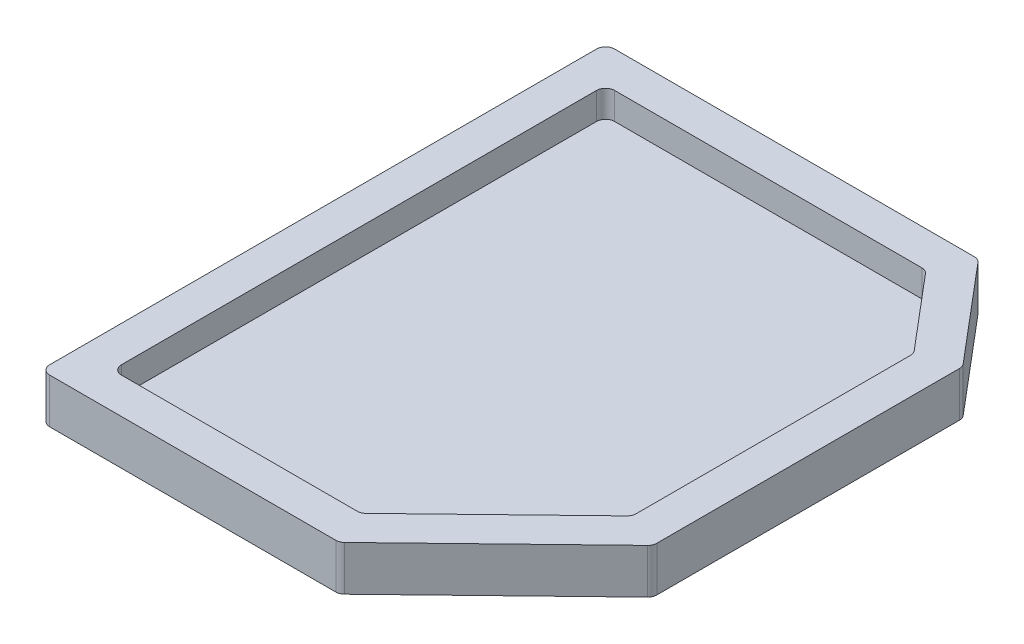
ISO-10303-21;
HEADER;
FILE_DESCRIPTION(('STEP AP214'),'2;1');
FILE_NAME('part.step','',(''),(''),'','','');
FILE_SCHEMA(('AUTOMOTIVE_DESIGN { 1 0 10303 214 1 1 1 1 }'));
ENDSEC;
DATA;
#1=APPLICATION_CONTEXT('core data for automotive mechanical design processes');
#2=APPLICATION_PROTOCOL_DEFINITION('international standard','automotive_design',2000,#1);
#3=PRODUCT_CONTEXT('',#1,'mechanical');
#4=PRODUCT('Part','Part','',(#3));
#5=PRODUCT_RELATED_PRODUCT_CATEGORY('part','',(#4));
#6=PRODUCT_DEFINITION_FORMATION('','',#4);
#7=PRODUCT_DEFINITION_CONTEXT('part definition',#1,'design');
#8=PRODUCT_DEFINITION('design','',#6,#7);
#9=PRODUCT_DEFINITION_SHAPE('','',#8);
#10=(LENGTH_UNIT() NAMED_UNIT(*) SI_UNIT(.MILLI.,.METRE.));
#11=(NAMED_UNIT(*) PLANE_ANGLE_UNIT() SI_UNIT($,.RADIAN.));
#12=(NAMED_UNIT(*) SI_UNIT($,.STERADIAN.) SOLID_ANGLE_UNIT());
#13=UNCERTAINTY_MEASURE_WITH_UNIT(LENGTH_MEASURE(1.E-05),#10,'distance_accuracy_value','');
#14=(GEOMETRIC_REPRESENTATION_CONTEXT(3) GLOBAL_UNCERTAINTY_ASSIGNED_CONTEXT((#13)) GLOBAL_UNIT_ASSIGNED_CONTEXT((#10,
#11,#12)) REPRESENTATION_CONTEXT('',''));
#15=CARTESIAN_POINT('',(0.,0.,0.));
#16=DIRECTION('',(0.,0.,1.));
#17=DIRECTION('',(1.,0.,0.));
#18=AXIS2_PLACEMENT_3D('',#15,#16,#17);
#19=CARTESIAN_POINT('',(0.,5.,0.));
#20=DIRECTION('',(0.,-1.,0.));
#21=DIRECTION('',(0.,0.,-1.));
#22=AXIS2_PLACEMENT_3D('',#19,#20,#21);
#23=PLANE('',#22);
#24=DIRECTION('',(-1.,0.,0.));
#25=VECTOR('',#24,1.);
#26=CARTESIAN_POINT('',(-4.5,5.,-58.5));
#27=LINE('',#26,#25);
#28=CARTESIAN_POINT('',(36.6251985368632,5.,-58.5));
#29=VERTEX_POINT('',#28);
#30=CARTESIAN_POINT('',(-3.5,5.,-58.5));
#31=VERTEX_POINT('',#30);
#32=EDGE_CURVE('E455',#29,#31,#27,.T.);
#33=ORIENTED_EDGE('',*,*,#32,.T.);
#34=CARTESIAN_POINT('',(-3.5,5.,-57.5));
#35=DIRECTION('',(0.,-1.,0.));
#36=DIRECTION('',(0.,0.,-1.));
#37=AXIS2_PLACEMENT_3D('',#34,#35,#36);
#38=CIRCLE('',#37,1.);
#39=CARTESIAN_POINT('',(-4.5,5.,-57.5));
#40=VERTEX_POINT('',#39);
#41=EDGE_CURVE('E278',#31,#40,#38,.F.);
#42=ORIENTED_EDGE('',*,*,#41,.T.);
#43=DIRECTION('',(0.,0.,1.));
#44=VECTOR('',#43,1.);
#45=CARTESIAN_POINT('',(-4.5,5.,4.5));
#46=LINE('',#45,#44);
#47=CARTESIAN_POINT('',(-4.5,5.,3.5));
#48=VERTEX_POINT('',#47);
#49=EDGE_CURVE('E223',#40,#48,#46,.T.);
#50=ORIENTED_EDGE('',*,*,#49,.T.);
#51=CARTESIAN_POINT('',(-3.5,5.,3.5));
#52=DIRECTION('',(0.,-1.,0.));
#53=DIRECTION('',(0.,0.,-1.));
#54=AXIS2_PLACEMENT_3D('',#51,#52,#53);
#55=CIRCLE('',#54,1.);
#56=CARTESIAN_POINT('',(-3.5,5.,4.5));
#57=VERTEX_POINT('',#56);
#58=EDGE_CURVE('E269',#48,#57,#55,.F.);
#59=ORIENTED_EDGE('',*,*,#58,.T.);
#60=DIRECTION('',(1.,0.,0.));
#61=VECTOR('',#60,1.);
#62=CARTESIAN_POINT('',(28.8196040629854,5.,4.5));
#63=LINE('',#62,#61);
#64=CARTESIAN_POINT('',(28.4152476045442,5.,4.5));
#65=VERTEX_POINT('',#64);
#66=EDGE_CURVE('E232',#57,#65,#63,.T.);
#67=ORIENTED_EDGE('',*,*,#66,.T.);
#68=CARTESIAN_POINT('',(28.4152476045442,5.,3.5));
#69=DIRECTION('',(0.,-1.,0.));
#70=DIRECTION('',(0.,0.,-1.));
#71=AXIS2_PLACEMENT_3D('',#68,#69,#70);
#72=CIRCLE('',#71,1.);
#73=CARTESIAN_POINT('',(29.1103142444199,5.,4.21894531511923));
#74=VERTEX_POINT('',#73);
#75=EDGE_CURVE('E266',#65,#74,#72,.F.);
#76=ORIENTED_EDGE('',*,*,#75,.T.);
#77=DIRECTION('',(0.718945315119227,0.,-0.695066639875714));
#78=VECTOR('',#77,1.);
#79=CARTESIAN_POINT('',(46.5978516175038,5.,-12.6877700998002));
#80=LINE('',#79,#78);
#81=CARTESIAN_POINT('',(46.2929182573795,5.,-12.3929646374787));
#82=VERTEX_POINT('',#81);
#83=EDGE_CURVE('E238',#74,#82,#80,.T.);
#84=ORIENTED_EDGE('',*,*,#83,.T.);
#85=CARTESIAN_POINT('',(45.5978516175038,5.,-13.1119099525979));
#86=DIRECTION('',(0.,-1.,0.));
#87=DIRECTION('',(0.,0.,-1.));
#88=AXIS2_PLACEMENT_3D('',#85,#86,#87);
#89=CIRCLE('',#88,1.);
#90=CARTESIAN_POINT('',(46.5978516175038,5.,-13.1119099525979));
#91=VERTEX_POINT('',#90);
#92=EDGE_CURVE('E263',#82,#91,#89,.F.);
#93=ORIENTED_EDGE('',*,*,#92,.T.);
#94=DIRECTION('',(0.,0.,-1.));
#95=VECTOR('',#94,1.);
#96=CARTESIAN_POINT('',(46.5978516175038,5.,-47.2425028075199));
#97=LINE('',#96,#95);
#98=CARTESIAN_POINT('',(46.5978516175038,5.,-46.8767020586021));
#99=VERTEX_POINT('',#98);
#100=EDGE_CURVE('E447',#91,#99,#97,.T.);
#101=ORIENTED_EDGE('',*,*,#100,.T.);
#102=CARTESIAN_POINT('',(45.5978516175038,5.,-46.8767020586021));
#103=DIRECTION('',(0.,-1.,0.));
#104=DIRECTION('',(0.,0.,-1.));
#105=AXIS2_PLACEMENT_3D('',#102,#103,#104);
#106=CIRCLE('',#105,1.);
#107=CARTESIAN_POINT('',(46.3618153050138,5.,-47.521961296557));
#108=VERTEX_POINT('',#107);
#109=EDGE_CURVE('E272',#99,#108,#106,.F.);
#110=ORIENTED_EDGE('',*,*,#109,.T.);
#111=DIRECTION('',(-0.645259237954887,0.,-0.763963687510001));
#112=VECTOR('',#111,1.);
#113=CARTESIAN_POINT('',(37.089540975967,5.,-58.5));
#114=LINE('',#113,#112);
#115=CARTESIAN_POINT('',(37.3891622243732,5.,-58.1452592379549));
#116=VERTEX_POINT('',#115);
#117=EDGE_CURVE('E451',#108,#116,#114,.T.);
#118=ORIENTED_EDGE('',*,*,#117,.T.);
#119=CARTESIAN_POINT('',(36.6251985368632,5.,-57.5));
#120=DIRECTION('',(0.,-1.,0.));
#121=DIRECTION('',(0.,0.,-1.));
#122=AXIS2_PLACEMENT_3D('',#119,#120,#121);
#123=CIRCLE('',#122,1.);
#124=EDGE_CURVE('E275',#116,#29,#123,.F.);
#125=ORIENTED_EDGE('',*,*,#124,.T.);
#126=EDGE_LOOP('',(#33,#42,#50,#59,#67,#76,#84,#93,#101,#110,#118,#125));
#127=FACE_BOUND('',#126,.T.);
#128=DIRECTION('',(1.,0.,0.));
#129=VECTOR('',#128,1.);
#130=CARTESIAN_POINT('',(27.2021782292206,5.,0.5));
#131=LINE('',#130,#129);
#132=CARTESIAN_POINT('',(0.5,5.,0.5));
#133=VERTEX_POINT('',#132);
#134=CARTESIAN_POINT('',(26.7978217707794,5.,0.5));
#135=VERTEX_POINT('',#134);
#136=EDGE_CURVE('E383',#133,#135,#131,.T.);
#137=ORIENTED_EDGE('',*,*,#136,.F.);
#138=CARTESIAN_POINT('',(0.5,5.,-0.5));
#139=DIRECTION('',(0.,-1.,0.));
#140=DIRECTION('',(0.,0.,-1.));
#141=AXIS2_PLACEMENT_3D('',#138,#139,#140);
#142=CIRCLE('',#141,1.);
#143=CARTESIAN_POINT('',(-0.5,5.,-0.5));
#144=VERTEX_POINT('',#143);
#145=EDGE_CURVE('E11',#133,#144,#142,.T.);
#146=ORIENTED_EDGE('',*,*,#145,.T.);
#147=DIRECTION('',(0.,0.,1.));
#148=VECTOR('',#147,1.);
#149=CARTESIAN_POINT('',(-0.5,5.,0.5));
#150=LINE('',#149,#148);
#151=CARTESIAN_POINT('',(-0.5,5.,-53.5));
#152=VERTEX_POINT('',#151);
#153=EDGE_CURVE('E439',#152,#144,#150,.T.);
#154=ORIENTED_EDGE('',*,*,#153,.F.);
#155=CARTESIAN_POINT('',(0.5,5.,-53.5));
#156=DIRECTION('',(0.,-1.,0.));
#157=DIRECTION('',(0.,0.,-1.));
#158=AXIS2_PLACEMENT_3D('',#155,#156,#157);
#159=CIRCLE('',#158,1.);
#160=CARTESIAN_POINT('',(0.5,5.,-54.5));
#161=VERTEX_POINT('',#160);
#162=EDGE_CURVE('E366',#152,#161,#159,.T.);
#163=ORIENTED_EDGE('',*,*,#162,.T.);
#164=DIRECTION('',(-1.,0.,0.));
#165=VECTOR('',#164,1.);
#166=CARTESIAN_POINT('',(-0.5,5.,-54.5));
#167=LINE('',#166,#165);
#168=CARTESIAN_POINT('',(34.7678287804481,5.,-54.5));
#169=VERTEX_POINT('',#168);
#170=EDGE_CURVE('E435',#169,#161,#167,.T.);
#171=ORIENTED_EDGE('',*,*,#170,.F.);
#172=CARTESIAN_POINT('',(34.7678287804481,5.,-53.5));
#173=DIRECTION('',(0.,-1.,0.));
#174=DIRECTION('',(0.,0.,-1.));
#175=AXIS2_PLACEMENT_3D('',#172,#173,#174);
#176=CIRCLE('',#175,1.);
#177=CARTESIAN_POINT('',(35.5317924679581,5.,-54.1452592379549));
#178=VERTEX_POINT('',#177);
#179=EDGE_CURVE('E369',#169,#178,#176,.T.);
#180=ORIENTED_EDGE('',*,*,#179,.T.);
#181=DIRECTION('',(-0.645259237954887,0.,-0.763963687510001));
#182=VECTOR('',#181,1.);
#183=CARTESIAN_POINT('',(35.2321712195519,5.,-54.5));
#184=LINE('',#183,#182);
#185=CARTESIAN_POINT('',(42.3618153050138,5.,-46.058758300886));
#186=VERTEX_POINT('',#185);
#187=EDGE_CURVE('E431',#186,#178,#184,.T.);
#188=ORIENTED_EDGE('',*,*,#187,.F.);
#189=CARTESIAN_POINT('',(41.5978516175038,5.,-45.4134990629311));
#190=DIRECTION('',(0.,-1.,0.));
#191=DIRECTION('',(0.,0.,-1.));
#192=AXIS2_PLACEMENT_3D('',#189,#190,#191);
#193=CIRCLE('',#192,1.);
#194=CARTESIAN_POINT('',(42.5978516175038,5.,-45.4134990629311));
#195=VERTEX_POINT('',#194);
#196=EDGE_CURVE('E372',#186,#195,#193,.T.);
#197=ORIENTED_EDGE('',*,*,#196,.T.);
#198=DIRECTION('',(0.,0.,-1.));
#199=VECTOR('',#198,1.);
#200=CARTESIAN_POINT('',(42.5978516175038,5.,-45.7792998118489));
#201=LINE('',#200,#199);
#202=CARTESIAN_POINT('',(42.5978516175038,5.,-14.8084693637889));
#203=VERTEX_POINT('',#202);
#204=EDGE_CURVE('E427',#203,#195,#201,.T.);
#205=ORIENTED_EDGE('',*,*,#204,.F.);
#206=CARTESIAN_POINT('',(41.5978516175038,5.,-14.8084693637889));
#207=DIRECTION('',(0.,-1.,0.));
#208=DIRECTION('',(0.,0.,-1.));
#209=AXIS2_PLACEMENT_3D('',#206,#207,#208);
#210=CIRCLE('',#209,1.);
#211=CARTESIAN_POINT('',(42.2929182573795,5.,-14.0895240486696));
#212=VERTEX_POINT('',#211);
#213=EDGE_CURVE('E375',#203,#212,#210,.T.);
#214=ORIENTED_EDGE('',*,*,#213,.T.);
#215=DIRECTION('',(0.718945315119227,0.,-0.695066639875714));
#216=VECTOR('',#215,1.);
#217=CARTESIAN_POINT('',(42.5978516175038,5.,-14.3843295109911));
#218=LINE('',#217,#216);
#219=CARTESIAN_POINT('',(27.4928884106551,5.,0.218945315119227));
#220=VERTEX_POINT('',#219);
#221=EDGE_CURVE('E386',#220,#212,#218,.T.);
#222=ORIENTED_EDGE('',*,*,#221,.F.);
#223=CARTESIAN_POINT('',(26.7978217707794,5.,-0.5));
#224=DIRECTION('',(0.,-1.,0.));
#225=DIRECTION('',(0.,0.,-1.));
#226=AXIS2_PLACEMENT_3D('',#223,#224,#225);
#227=CIRCLE('',#226,1.);
#228=EDGE_CURVE('E48',#220,#135,#227,.T.);
#229=ORIENTED_EDGE('',*,*,#228,.T.);
#230=EDGE_LOOP('',(#137,#146,#154,#163,#171,#180,#188,#197,#205,#214,#222,#229));
#231=FACE_BOUND('',#230,.T.);
#232=ADVANCED_FACE('F39',(#127,#231),#23,.F.);
#233=CARTESIAN_POINT('',(0.,0.,0.));
#234=DIRECTION('',(0.,-1.,0.));
#235=DIRECTION('',(0.,0.,-1.));
#236=AXIS2_PLACEMENT_3D('',#233,#234,#235);
#237=PLANE('',#236);
#238=DIRECTION('',(0.,0.,1.));
#239=VECTOR('',#238,1.);
#240=CARTESIAN_POINT('',(-4.5,0.,4.5));
#241=LINE('',#240,#239);
#242=CARTESIAN_POINT('',(-4.5,0.,-57.5));
#243=VERTEX_POINT('',#242);
#244=CARTESIAN_POINT('',(-4.5,0.,3.5));
#245=VERTEX_POINT('',#244);
#246=EDGE_CURVE('E220',#243,#245,#241,.T.);
#247=ORIENTED_EDGE('',*,*,#246,.F.);
#248=CARTESIAN_POINT('',(-3.5,0.,-57.5));
#249=DIRECTION('',(0.,-1.,0.));
#250=DIRECTION('',(0.,0.,-1.));
#251=AXIS2_PLACEMENT_3D('',#248,#249,#250);
#252=CIRCLE('',#251,1.);
#253=CARTESIAN_POINT('',(-3.5,0.,-58.5));
#254=VERTEX_POINT('',#253);
#255=EDGE_CURVE('E202',#243,#254,#252,.T.);
#256=ORIENTED_EDGE('',*,*,#255,.T.);
#257=DIRECTION('',(-1.,0.,0.));
#258=VECTOR('',#257,1.);
#259=CARTESIAN_POINT('',(-4.5,0.,-58.5));
#260=LINE('',#259,#258);
#261=CARTESIAN_POINT('',(36.6251985368632,0.,-58.5));
#262=VERTEX_POINT('',#261);
#263=EDGE_CURVE('E233',#262,#254,#260,.T.);
#264=ORIENTED_EDGE('',*,*,#263,.F.);
#265=CARTESIAN_POINT('',(36.6251985368632,0.,-57.5));
#266=DIRECTION('',(0.,-1.,0.));
#267=DIRECTION('',(0.,0.,-1.));
#268=AXIS2_PLACEMENT_3D('',#265,#266,#267);
#269=CIRCLE('',#268,1.);
#270=CARTESIAN_POINT('',(37.3891622243732,0.,-58.1452592379549));
#271=VERTEX_POINT('',#270);
#272=EDGE_CURVE('E214',#262,#271,#269,.T.);
#273=ORIENTED_EDGE('',*,*,#272,.T.);
#274=DIRECTION('',(-0.645259237954887,0.,-0.763963687510001));
#275=VECTOR('',#274,1.);
#276=CARTESIAN_POINT('',(37.089540975967,0.,-58.5));
#277=LINE('',#276,#275);
#278=CARTESIAN_POINT('',(46.3618153050138,0.,-47.521961296557));
#279=VERTEX_POINT('',#278);
#280=EDGE_CURVE('E240',#279,#271,#277,.T.);
#281=ORIENTED_EDGE('',*,*,#280,.F.);
#282=CARTESIAN_POINT('',(45.5978516175038,0.,-46.8767020586021));
#283=DIRECTION('',(0.,-1.,0.));
#284=DIRECTION('',(0.,0.,-1.));
#285=AXIS2_PLACEMENT_3D('',#282,#283,#284);
#286=CIRCLE('',#285,1.);
#287=CARTESIAN_POINT('',(46.5978516175038,0.,-46.8767020586021));
#288=VERTEX_POINT('',#287);
#289=EDGE_CURVE('E253',#279,#288,#286,.T.);
#290=ORIENTED_EDGE('',*,*,#289,.T.);
#291=DIRECTION('',(0.,0.,-1.));
#292=VECTOR('',#291,1.);
#293=CARTESIAN_POINT('',(46.5978516175038,0.,-47.2425028075199));
#294=LINE('',#293,#292);
#295=CARTESIAN_POINT('',(46.5978516175038,0.,-13.1119099525979));
#296=VERTEX_POINT('',#295);
#297=EDGE_CURVE('E468',#296,#288,#294,.T.);
#298=ORIENTED_EDGE('',*,*,#297,.F.);
#299=CARTESIAN_POINT('',(45.5978516175038,0.,-13.1119099525979));
#300=DIRECTION('',(0.,-1.,0.));
#301=DIRECTION('',(0.,0.,-1.));
#302=AXIS2_PLACEMENT_3D('',#299,#300,#301);
#303=CIRCLE('',#302,1.);
#304=CARTESIAN_POINT('',(46.2929182573795,0.,-12.3929646374787));
#305=VERTEX_POINT('',#304);
#306=EDGE_CURVE('E225',#296,#305,#303,.T.);
#307=ORIENTED_EDGE('',*,*,#306,.T.);
#308=DIRECTION('',(0.718945315119227,0.,-0.695066639875714));
#309=VECTOR('',#308,1.);
#310=CARTESIAN_POINT('',(46.5978516175038,0.,-12.6877700998002));
#311=LINE('',#310,#309);
#312=CARTESIAN_POINT('',(29.1103142444199,0.,4.21894531511923));
#313=VERTEX_POINT('',#312);
#314=EDGE_CURVE('E464',#313,#305,#311,.T.);
#315=ORIENTED_EDGE('',*,*,#314,.F.);
#316=CARTESIAN_POINT('',(28.4152476045442,0.,3.5));
#317=DIRECTION('',(0.,-1.,0.));
#318=DIRECTION('',(0.,0.,-1.));
#319=AXIS2_PLACEMENT_3D('',#316,#317,#318);
#320=CIRCLE('',#319,1.);
#321=CARTESIAN_POINT('',(28.4152476045442,0.,4.5));
#322=VERTEX_POINT('',#321);
#323=EDGE_CURVE('E248',#313,#322,#320,.T.);
#324=ORIENTED_EDGE('',*,*,#323,.T.);
#325=DIRECTION('',(1.,0.,0.));
#326=VECTOR('',#325,1.);
#327=CARTESIAN_POINT('',(28.8196040629854,0.,4.5));
#328=LINE('',#327,#326);
#329=CARTESIAN_POINT('',(-3.5,0.,4.5));
#330=VERTEX_POINT('',#329);
#331=EDGE_CURVE('E442',#330,#322,#328,.T.);
#332=ORIENTED_EDGE('',*,*,#331,.F.);
#333=CARTESIAN_POINT('',(-3.5,0.,3.5));
#334=DIRECTION('',(0.,-1.,0.));
#335=DIRECTION('',(0.,0.,-1.));
#336=AXIS2_PLACEMENT_3D('',#333,#334,#335);
#337=CIRCLE('',#336,1.);
#338=EDGE_CURVE('E230',#330,#245,#337,.T.);
#339=ORIENTED_EDGE('',*,*,#338,.T.);
#340=EDGE_LOOP('',(#247,#256,#264,#273,#281,#290,#298,#307,#315,#324,#332,#339));
#341=FACE_BOUND('',#340,.T.);
#342=ADVANCED_FACE('F228',(#341),#237,.T.);
#343=CARTESIAN_POINT('',(28.8196040629854,5.,4.5));
#344=DIRECTION('',(0.,0.,-1.));
#345=DIRECTION('',(-1.,0.,0.));
#346=AXIS2_PLACEMENT_3D('',#343,#344,#345);
#347=PLANE('',#346);
#348=ORIENTED_EDGE('',*,*,#66,.F.);
#349=DIRECTION('',(0.,-1.,0.));
#350=VECTOR('',#349,1.);
#351=CARTESIAN_POINT('',(-3.5,5.,4.5));
#352=LINE('',#351,#350);
#353=EDGE_CURVE('E298',#57,#330,#352,.T.);
#354=ORIENTED_EDGE('',*,*,#353,.T.);
#355=ORIENTED_EDGE('',*,*,#331,.T.);
#356=DIRECTION('',(0.,-1.,0.));
#357=VECTOR('',#356,1.);
#358=CARTESIAN_POINT('',(28.4152476045442,5.,4.5));
#359=LINE('',#358,#357);
#360=EDGE_CURVE('E295',#322,#65,#359,.F.);
#361=ORIENTED_EDGE('',*,*,#360,.T.);
#362=EDGE_LOOP('',(#348,#354,#355,#361));
#363=FACE_BOUND('',#362,.T.);
#364=ADVANCED_FACE('F501',(#363),#347,.F.);
#365=CARTESIAN_POINT('',(46.5978516175038,5.,-12.6877700998002));
#366=DIRECTION('',(-0.695066639875714,0.,-0.718945315119227));
#367=DIRECTION('',(-0.718945315119227,0.,0.695066639875714));
#368=AXIS2_PLACEMENT_3D('',#365,#366,#367);
#369=PLANE('',#368);
#370=ORIENTED_EDGE('',*,*,#83,.F.);
#371=DIRECTION('',(0.,-1.,0.));
#372=VECTOR('',#371,1.);
#373=CARTESIAN_POINT('',(29.1103142444199,5.,4.21894531511923));
#374=LINE('',#373,#372);
#375=EDGE_CURVE('E305',#74,#313,#374,.T.);
#376=ORIENTED_EDGE('',*,*,#375,.T.);
#377=ORIENTED_EDGE('',*,*,#314,.T.);
#378=DIRECTION('',(0.,-1.,0.));
#379=VECTOR('',#378,1.);
#380=CARTESIAN_POINT('',(46.2929182573795,5.,-12.3929646374787));
#381=LINE('',#380,#379);
#382=EDGE_CURVE('E302',#305,#82,#381,.F.);
#383=ORIENTED_EDGE('',*,*,#382,.T.);
#384=EDGE_LOOP('',(#370,#376,#377,#383));
#385=FACE_BOUND('',#384,.T.);
#386=ADVANCED_FACE('F718',(#385),#369,.F.);
#387=CARTESIAN_POINT('',(46.5978516175038,5.,-47.2425028075199));
#388=DIRECTION('',(-1.,0.,0.));
#389=DIRECTION('',(0.,0.,1.));
#390=AXIS2_PLACEMENT_3D('',#387,#388,#389);
#391=PLANE('',#390);
#392=ORIENTED_EDGE('',*,*,#297,.T.);
#393=DIRECTION('',(0.,-1.,0.));
#394=VECTOR('',#393,1.);
#395=CARTESIAN_POINT('',(46.5978516175038,5.,-46.8767020586021));
#396=LINE('',#395,#394);
#397=EDGE_CURVE('E292',#288,#99,#396,.F.);
#398=ORIENTED_EDGE('',*,*,#397,.T.);
#399=ORIENTED_EDGE('',*,*,#100,.F.);
#400=DIRECTION('',(0.,-1.,0.));
#401=VECTOR('',#400,1.);
#402=CARTESIAN_POINT('',(46.5978516175038,5.,-13.1119099525979));
#403=LINE('',#402,#401);
#404=EDGE_CURVE('E288',#91,#296,#403,.T.);
#405=ORIENTED_EDGE('',*,*,#404,.T.);
#406=EDGE_LOOP('',(#392,#398,#399,#405));
#407=FACE_BOUND('',#406,.T.);
#408=ADVANCED_FACE('F494',(#407),#391,.F.);
#409=CARTESIAN_POINT('',(37.089540975967,5.,-58.5));
#410=DIRECTION('',(-0.763963687510001,0.,0.645259237954887));
#411=DIRECTION('',(0.645259237954887,0.,0.763963687510001));
#412=AXIS2_PLACEMENT_3D('',#409,#410,#411);
#413=PLANE('',#412);
#414=ORIENTED_EDGE('',*,*,#280,.T.);
#415=DIRECTION('',(0.,-1.,0.));
#416=VECTOR('',#415,1.);
#417=CARTESIAN_POINT('',(37.3891622243732,5.,-58.1452592379549));
#418=LINE('',#417,#416);
#419=EDGE_CURVE('E285',#271,#116,#418,.F.);
#420=ORIENTED_EDGE('',*,*,#419,.T.);
#421=ORIENTED_EDGE('',*,*,#117,.F.);
#422=DIRECTION('',(0.,-1.,0.));
#423=VECTOR('',#422,1.);
#424=CARTESIAN_POINT('',(46.3618153050138,5.,-47.521961296557));
#425=LINE('',#424,#423);
#426=EDGE_CURVE('E281',#108,#279,#425,.T.);
#427=ORIENTED_EDGE('',*,*,#426,.T.);
#428=EDGE_LOOP('',(#414,#420,#421,#427));
#429=FACE_BOUND('',#428,.T.);
#430=ADVANCED_FACE('F476',(#429),#413,.F.);
#431=CARTESIAN_POINT('',(-4.5,5.,-58.5));
#432=DIRECTION('',(0.,0.,1.));
#433=DIRECTION('',(1.,0.,0.));
#434=AXIS2_PLACEMENT_3D('',#431,#432,#433);
#435=PLANE('',#434);
#436=ORIENTED_EDGE('',*,*,#263,.T.);
#437=DIRECTION('',(0.,-1.,0.));
#438=VECTOR('',#437,1.);
#439=CARTESIAN_POINT('',(-3.5,5.,-58.5));
#440=LINE('',#439,#438);
#441=EDGE_CURVE('E207',#254,#31,#440,.F.);
#442=ORIENTED_EDGE('',*,*,#441,.T.);
#443=ORIENTED_EDGE('',*,*,#32,.F.);
#444=DIRECTION('',(0.,-1.,0.));
#445=VECTOR('',#444,1.);
#446=CARTESIAN_POINT('',(36.6251985368632,5.,-58.5));
#447=LINE('',#446,#445);
#448=EDGE_CURVE('E213',#29,#262,#447,.T.);
#449=ORIENTED_EDGE('',*,*,#448,.T.);
#450=EDGE_LOOP('',(#436,#442,#443,#449));
#451=FACE_BOUND('',#450,.T.);
#452=ADVANCED_FACE('F486',(#451),#435,.F.);
#453=CARTESIAN_POINT('',(-4.5,5.,4.5));
#454=DIRECTION('',(1.,0.,0.));
#455=DIRECTION('',(0.,0.,-1.));
#456=AXIS2_PLACEMENT_3D('',#453,#454,#455);
#457=PLANE('',#456);
#458=ORIENTED_EDGE('',*,*,#49,.F.);
#459=DIRECTION('',(0.,-1.,0.));
#460=VECTOR('',#459,1.);
#461=CARTESIAN_POINT('',(-4.5,5.,-57.5));
#462=LINE('',#461,#460);
#463=EDGE_CURVE('E206',#40,#243,#462,.T.);
#464=ORIENTED_EDGE('',*,*,#463,.T.);
#465=ORIENTED_EDGE('',*,*,#246,.T.);
#466=DIRECTION('',(0.,-1.,0.));
#467=VECTOR('',#466,1.);
#468=CARTESIAN_POINT('',(-4.5,5.,3.5));
#469=LINE('',#468,#467);
#470=EDGE_CURVE('E226',#245,#48,#469,.F.);
#471=ORIENTED_EDGE('',*,*,#470,.T.);
#472=EDGE_LOOP('',(#458,#464,#465,#471));
#473=FACE_BOUND('',#472,.T.);
#474=ADVANCED_FACE('F219',(#473),#457,.F.);
#475=CARTESIAN_POINT('',(27.2021782292206,5.,0.5));
#476=DIRECTION('',(0.,0.,-1.));
#477=DIRECTION('',(-1.,0.,0.));
#478=AXIS2_PLACEMENT_3D('',#475,#476,#477);
#479=PLANE('',#478);
#480=ORIENTED_EDGE('',*,*,#136,.T.);
#481=DIRECTION('',(0.,-1.,0.));
#482=VECTOR('',#481,1.);
#483=CARTESIAN_POINT('',(26.7978217707794,2.,0.5));
#484=LINE('',#483,#482);
#485=CARTESIAN_POINT('',(26.7978217707794,2.,0.5));
#486=VERTEX_POINT('',#485);
#487=EDGE_CURVE('E362',#135,#486,#484,.T.);
#488=ORIENTED_EDGE('',*,*,#487,.T.);
#489=DIRECTION('',(-1.,0.,0.));
#490=VECTOR('',#489,1.);
#491=CARTESIAN_POINT('',(0.,2.,0.5));
#492=LINE('',#491,#490);
#493=CARTESIAN_POINT('',(0.5,2.,0.5));
#494=VERTEX_POINT('',#493);
#495=EDGE_CURVE('E402',#486,#494,#492,.T.);
#496=ORIENTED_EDGE('',*,*,#495,.T.);
#497=DIRECTION('',(0.,-1.,0.));
#498=VECTOR('',#497,1.);
#499=CARTESIAN_POINT('',(0.5,5.,0.5));
#500=LINE('',#499,#498);
#501=EDGE_CURVE('E359',#494,#133,#500,.F.);
#502=ORIENTED_EDGE('',*,*,#501,.T.);
#503=EDGE_LOOP('',(#480,#488,#496,#502));
#504=FACE_BOUND('',#503,.T.);
#505=ADVANCED_FACE('F391',(#504),#479,.T.);
#506=CARTESIAN_POINT('',(42.5978516175038,5.,-14.3843295109911));
#507=DIRECTION('',(-0.695066639875714,0.,-0.718945315119227));
#508=DIRECTION('',(-0.718945315119227,0.,0.695066639875714));
#509=AXIS2_PLACEMENT_3D('',#506,#507,#508);
#510=PLANE('',#509);
#511=ORIENTED_EDGE('',*,*,#221,.T.);
#512=DIRECTION('',(0.,-1.,0.));
#513=VECTOR('',#512,1.);
#514=CARTESIAN_POINT('',(42.2929182573795,2.,-14.0895240486696));
#515=LINE('',#514,#513);
#516=CARTESIAN_POINT('',(42.2929182573795,2.,-14.0895240486696));
#517=VERTEX_POINT('',#516);
#518=EDGE_CURVE('E355',#212,#517,#515,.T.);
#519=ORIENTED_EDGE('',*,*,#518,.T.);
#520=DIRECTION('',(-0.718945315119227,0.,0.695066639875714));
#521=VECTOR('',#520,1.);
#522=CARTESIAN_POINT('',(13.391709434377,2.,13.8517750772859));
#523=LINE('',#522,#521);
#524=CARTESIAN_POINT('',(27.4928884106551,2.,0.218945315119231));
#525=VERTEX_POINT('',#524);
#526=EDGE_CURVE('E401',#517,#525,#523,.T.);
#527=ORIENTED_EDGE('',*,*,#526,.T.);
#528=DIRECTION('',(0.,-1.,0.));
#529=VECTOR('',#528,1.);
#530=CARTESIAN_POINT('',(27.4928884106551,5.,0.218945315119227));
#531=LINE('',#530,#529);
#532=EDGE_CURVE('E352',#525,#220,#531,.F.);
#533=ORIENTED_EDGE('',*,*,#532,.T.);
#534=EDGE_LOOP('',(#511,#519,#527,#533));
#535=FACE_BOUND('',#534,.T.);
#536=ADVANCED_FACE('F404',(#535),#510,.T.);
#537=CARTESIAN_POINT('',(42.5978516175038,5.,-45.7792998118489));
#538=DIRECTION('',(-1.,0.,0.));
#539=DIRECTION('',(0.,0.,1.));
#540=AXIS2_PLACEMENT_3D('',#537,#538,#539);
#541=PLANE('',#540);
#542=ORIENTED_EDGE('',*,*,#204,.T.);
#543=DIRECTION('',(0.,-1.,0.));
#544=VECTOR('',#543,1.);
#545=CARTESIAN_POINT('',(42.5978516175038,2.,-45.4134990629311));
#546=LINE('',#545,#544);
#547=CARTESIAN_POINT('',(42.5978516175038,2.,-45.4134990629311));
#548=VERTEX_POINT('',#547);
#549=EDGE_CURVE('E348',#195,#548,#546,.T.);
#550=ORIENTED_EDGE('',*,*,#549,.T.);
#551=DIRECTION('',(0.,0.,1.));
#552=VECTOR('',#551,1.);
#553=CARTESIAN_POINT('',(42.5978516175038,2.,0.));
#554=LINE('',#553,#552);
#555=CARTESIAN_POINT('',(42.5978516175038,2.,-14.8084693637889));
#556=VERTEX_POINT('',#555);
#557=EDGE_CURVE('E407',#548,#556,#554,.T.);
#558=ORIENTED_EDGE('',*,*,#557,.T.);
#559=DIRECTION('',(0.,-1.,0.));
#560=VECTOR('',#559,1.);
#561=CARTESIAN_POINT('',(42.5978516175038,5.,-14.8084693637889));
#562=LINE('',#561,#560);
#563=EDGE_CURVE('E345',#556,#203,#562,.F.);
#564=ORIENTED_EDGE('',*,*,#563,.T.);
#565=EDGE_LOOP('',(#542,#550,#558,#564));
#566=FACE_BOUND('',#565,.T.);
#567=ADVANCED_FACE('F508',(#566),#541,.T.);
#568=CARTESIAN_POINT('',(35.2321712195519,5.,-54.5));
#569=DIRECTION('',(-0.763963687510001,0.,0.645259237954887));
#570=DIRECTION('',(0.645259237954887,0.,0.763963687510001));
#571=AXIS2_PLACEMENT_3D('',#568,#569,#570);
#572=PLANE('',#571);
#573=ORIENTED_EDGE('',*,*,#187,.T.);
#574=DIRECTION('',(0.,-1.,0.));
#575=VECTOR('',#574,1.);
#576=CARTESIAN_POINT('',(35.5317924679581,2.,-54.1452592379549));
#577=LINE('',#576,#575);
#578=CARTESIAN_POINT('',(35.5317924679581,2.,-54.1452592379549));
#579=VERTEX_POINT('',#578);
#580=EDGE_CURVE('E341',#178,#579,#577,.T.);
#581=ORIENTED_EDGE('',*,*,#580,.T.);
#582=DIRECTION('',(0.645259237954887,0.,0.763963687510001));
#583=VECTOR('',#582,1.);
#584=CARTESIAN_POINT('',(47.4289497466478,2.,-40.0594537029248));
#585=LINE('',#584,#583);
#586=CARTESIAN_POINT('',(42.3618153050138,2.,-46.058758300886));
#587=VERTEX_POINT('',#586);
#588=EDGE_CURVE('E412',#579,#587,#585,.T.);
#589=ORIENTED_EDGE('',*,*,#588,.T.);
#590=DIRECTION('',(0.,-1.,0.));
#591=VECTOR('',#590,1.);
#592=CARTESIAN_POINT('',(42.3618153050138,5.,-46.058758300886));
#593=LINE('',#592,#591);
#594=EDGE_CURVE('E338',#587,#186,#593,.F.);
#595=ORIENTED_EDGE('',*,*,#594,.T.);
#596=EDGE_LOOP('',(#573,#581,#589,#595));
#597=FACE_BOUND('',#596,.T.);
#598=ADVANCED_FACE('F511',(#597),#572,.T.);
#599=CARTESIAN_POINT('',(-0.5,5.,-54.5));
#600=DIRECTION('',(0.,0.,1.));
#601=DIRECTION('',(1.,0.,0.));
#602=AXIS2_PLACEMENT_3D('',#599,#600,#601);
#603=PLANE('',#602);
#604=ORIENTED_EDGE('',*,*,#170,.T.);
#605=DIRECTION('',(0.,-1.,0.));
#606=VECTOR('',#605,1.);
#607=CARTESIAN_POINT('',(0.5,2.,-54.5));
#608=LINE('',#607,#606);
#609=CARTESIAN_POINT('',(0.5,2.,-54.5));
#610=VERTEX_POINT('',#609);
#611=EDGE_CURVE('E312',#161,#610,#608,.T.);
#612=ORIENTED_EDGE('',*,*,#611,.T.);
#613=DIRECTION('',(1.,0.,0.));
#614=VECTOR('',#613,1.);
#615=CARTESIAN_POINT('',(0.,2.,-54.5));
#616=LINE('',#615,#614);
#617=CARTESIAN_POINT('',(34.7678287804481,2.,-54.5));
#618=VERTEX_POINT('',#617);
#619=EDGE_CURVE('E419',#610,#618,#616,.T.);
#620=ORIENTED_EDGE('',*,*,#619,.T.);
#621=DIRECTION('',(0.,-1.,0.));
#622=VECTOR('',#621,1.);
#623=CARTESIAN_POINT('',(34.7678287804481,5.,-54.5));
#624=LINE('',#623,#622);
#625=EDGE_CURVE('E309',#618,#169,#624,.F.);
#626=ORIENTED_EDGE('',*,*,#625,.T.);
#627=EDGE_LOOP('',(#604,#612,#620,#626));
#628=FACE_BOUND('',#627,.T.);
#629=ADVANCED_FACE('F515',(#628),#603,.T.);
#630=CARTESIAN_POINT('',(-0.5,5.,0.5));
#631=DIRECTION('',(1.,0.,0.));
#632=DIRECTION('',(0.,0.,-1.));
#633=AXIS2_PLACEMENT_3D('',#630,#631,#632);
#634=PLANE('',#633);
#635=DIRECTION('',(0.,0.,-1.));
#636=VECTOR('',#635,1.);
#637=CARTESIAN_POINT('',(-0.5,2.,0.));
#638=LINE('',#637,#636);
#639=CARTESIAN_POINT('',(-0.5,2.,-0.5));
#640=VERTEX_POINT('',#639);
#641=CARTESIAN_POINT('',(-0.5,2.,-53.5));
#642=VERTEX_POINT('',#641);
#643=EDGE_CURVE('E395',#640,#642,#638,.T.);
#644=ORIENTED_EDGE('',*,*,#643,.T.);
#645=DIRECTION('',(0.,-1.,0.));
#646=VECTOR('',#645,1.);
#647=CARTESIAN_POINT('',(-0.5,5.,-53.5));
#648=LINE('',#647,#646);
#649=EDGE_CURVE('E335',#642,#152,#648,.F.);
#650=ORIENTED_EDGE('',*,*,#649,.T.);
#651=ORIENTED_EDGE('',*,*,#153,.T.);
#652=DIRECTION('',(0.,-1.,0.));
#653=VECTOR('',#652,1.);
#654=CARTESIAN_POINT('',(-0.5,2.,-0.5));
#655=LINE('',#654,#653);
#656=EDGE_CURVE('E332',#144,#640,#655,.T.);
#657=ORIENTED_EDGE('',*,*,#656,.T.);
#658=EDGE_LOOP('',(#644,#650,#651,#657));
#659=FACE_BOUND('',#658,.T.);
#660=ADVANCED_FACE('F519',(#659),#634,.T.);
#661=CARTESIAN_POINT('',(0.,2.,0.));
#662=DIRECTION('',(0.,1.,0.));
#663=DIRECTION('',(0.,0.,1.));
#664=AXIS2_PLACEMENT_3D('',#661,#662,#663);
#665=PLANE('',#664);
#666=ORIENTED_EDGE('',*,*,#619,.F.);
#667=CARTESIAN_POINT('',(0.5,2.,-53.5));
#668=DIRECTION('',(0.,1.,0.));
#669=DIRECTION('',(0.,0.,1.));
#670=AXIS2_PLACEMENT_3D('',#667,#668,#669);
#671=CIRCLE('',#670,1.);
#672=EDGE_CURVE('E55',#610,#642,#671,.T.);
#673=ORIENTED_EDGE('',*,*,#672,.T.);
#674=ORIENTED_EDGE('',*,*,#643,.F.);
#675=CARTESIAN_POINT('',(0.5,2.,-0.5));
#676=DIRECTION('',(0.,1.,0.));
#677=DIRECTION('',(0.,0.,1.));
#678=AXIS2_PLACEMENT_3D('',#675,#676,#677);
#679=CIRCLE('',#678,1.);
#680=EDGE_CURVE('E63',#640,#494,#679,.T.);
#681=ORIENTED_EDGE('',*,*,#680,.T.);
#682=ORIENTED_EDGE('',*,*,#495,.F.);
#683=CARTESIAN_POINT('',(26.7978217707794,2.,-0.5));
#684=DIRECTION('',(0.,1.,0.));
#685=DIRECTION('',(0.,0.,1.));
#686=AXIS2_PLACEMENT_3D('',#683,#684,#685);
#687=CIRCLE('',#686,1.);
#688=EDGE_CURVE('E318',#486,#525,#687,.T.);
#689=ORIENTED_EDGE('',*,*,#688,.T.);
#690=ORIENTED_EDGE('',*,*,#526,.F.);
#691=CARTESIAN_POINT('',(41.5978516175038,2.,-14.8084693637889));
#692=DIRECTION('',(0.,1.,0.));
#693=DIRECTION('',(0.,0.,1.));
#694=AXIS2_PLACEMENT_3D('',#691,#692,#693);
#695=CIRCLE('',#694,1.);
#696=EDGE_CURVE('E321',#517,#556,#695,.T.);
#697=ORIENTED_EDGE('',*,*,#696,.T.);
#698=ORIENTED_EDGE('',*,*,#557,.F.);
#699=CARTESIAN_POINT('',(41.5978516175038,2.,-45.4134990629311));
#700=DIRECTION('',(0.,1.,0.));
#701=DIRECTION('',(0.,0.,1.));
#702=AXIS2_PLACEMENT_3D('',#699,#700,#701);
#703=CIRCLE('',#702,1.);
#704=EDGE_CURVE('E324',#548,#587,#703,.T.);
#705=ORIENTED_EDGE('',*,*,#704,.T.);
#706=ORIENTED_EDGE('',*,*,#588,.F.);
#707=CARTESIAN_POINT('',(34.7678287804481,2.,-53.5));
#708=DIRECTION('',(0.,1.,0.));
#709=DIRECTION('',(0.,0.,1.));
#710=AXIS2_PLACEMENT_3D('',#707,#708,#709);
#711=CIRCLE('',#710,1.);
#712=EDGE_CURVE('E327',#579,#618,#711,.T.);
#713=ORIENTED_EDGE('',*,*,#712,.T.);
#714=EDGE_LOOP('',(#666,#673,#674,#681,#682,#689,#690,#697,#698,#705,#706,#713));
#715=FACE_BOUND('',#714,.T.);
#716=ADVANCED_FACE('F400',(#715),#665,.T.);
#717=CARTESIAN_POINT('',(-3.5,5.,-57.5));
#718=DIRECTION('',(0.,-1.,0.));
#719=DIRECTION('',(0.,0.,-1.));
#720=AXIS2_PLACEMENT_3D('',#717,#718,#719);
#721=CYLINDRICAL_SURFACE('',#720,1.);
#722=ORIENTED_EDGE('',*,*,#41,.F.);
#723=ORIENTED_EDGE('',*,*,#441,.F.);
#724=ORIENTED_EDGE('',*,*,#255,.F.);
#725=ORIENTED_EDGE('',*,*,#463,.F.);
#726=EDGE_LOOP('',(#722,#723,#724,#725));
#727=FACE_BOUND('',#726,.T.);
#728=ADVANCED_FACE('F205',(#727),#721,.T.);
#729=CARTESIAN_POINT('',(36.6251985368632,5.,-57.5));
#730=DIRECTION('',(0.,-1.,0.));
#731=DIRECTION('',(0.,0.,-1.));
#732=AXIS2_PLACEMENT_3D('',#729,#730,#731);
#733=CYLINDRICAL_SURFACE('',#732,1.);
#734=ORIENTED_EDGE('',*,*,#124,.F.);
#735=ORIENTED_EDGE('',*,*,#419,.F.);
#736=ORIENTED_EDGE('',*,*,#272,.F.);
#737=ORIENTED_EDGE('',*,*,#448,.F.);
#738=EDGE_LOOP('',(#734,#735,#736,#737));
#739=FACE_BOUND('',#738,.T.);
#740=ADVANCED_FACE('F481',(#739),#733,.T.);
#741=CARTESIAN_POINT('',(45.5978516175038,5.,-46.8767020586021));
#742=DIRECTION('',(0.,-1.,0.));
#743=DIRECTION('',(0.,0.,-1.));
#744=AXIS2_PLACEMENT_3D('',#741,#742,#743);
#745=CYLINDRICAL_SURFACE('',#744,1.);
#746=ORIENTED_EDGE('',*,*,#109,.F.);
#747=ORIENTED_EDGE('',*,*,#397,.F.);
#748=ORIENTED_EDGE('',*,*,#289,.F.);
#749=ORIENTED_EDGE('',*,*,#426,.F.);
#750=EDGE_LOOP('',(#746,#747,#748,#749));
#751=FACE_BOUND('',#750,.T.);
#752=ADVANCED_FACE('F532',(#751),#745,.T.);
#753=CARTESIAN_POINT('',(-3.5,5.,3.5));
#754=DIRECTION('',(0.,-1.,0.));
#755=DIRECTION('',(0.,0.,-1.));
#756=AXIS2_PLACEMENT_3D('',#753,#754,#755);
#757=CYLINDRICAL_SURFACE('',#756,1.);
#758=ORIENTED_EDGE('',*,*,#58,.F.);
#759=ORIENTED_EDGE('',*,*,#470,.F.);
#760=ORIENTED_EDGE('',*,*,#338,.F.);
#761=ORIENTED_EDGE('',*,*,#353,.F.);
#762=EDGE_LOOP('',(#758,#759,#760,#761));
#763=FACE_BOUND('',#762,.T.);
#764=ADVANCED_FACE('F539',(#763),#757,.T.);
#765=CARTESIAN_POINT('',(28.4152476045442,5.,3.5));
#766=DIRECTION('',(0.,-1.,0.));
#767=DIRECTION('',(0.,0.,-1.));
#768=AXIS2_PLACEMENT_3D('',#765,#766,#767);
#769=CYLINDRICAL_SURFACE('',#768,1.);
#770=ORIENTED_EDGE('',*,*,#75,.F.);
#771=ORIENTED_EDGE('',*,*,#360,.F.);
#772=ORIENTED_EDGE('',*,*,#323,.F.);
#773=ORIENTED_EDGE('',*,*,#375,.F.);
#774=EDGE_LOOP('',(#770,#771,#772,#773));
#775=FACE_BOUND('',#774,.T.);
#776=ADVANCED_FACE('F543',(#775),#769,.T.);
#777=CARTESIAN_POINT('',(45.5978516175038,5.,-13.1119099525979));
#778=DIRECTION('',(0.,-1.,0.));
#779=DIRECTION('',(0.,0.,-1.));
#780=AXIS2_PLACEMENT_3D('',#777,#778,#779);
#781=CYLINDRICAL_SURFACE('',#780,1.);
#782=ORIENTED_EDGE('',*,*,#92,.F.);
#783=ORIENTED_EDGE('',*,*,#382,.F.);
#784=ORIENTED_EDGE('',*,*,#306,.F.);
#785=ORIENTED_EDGE('',*,*,#404,.F.);
#786=EDGE_LOOP('',(#782,#783,#784,#785));
#787=FACE_BOUND('',#786,.T.);
#788=ADVANCED_FACE('F547',(#787),#781,.T.);
#789=CARTESIAN_POINT('',(0.5,5.,-53.5));
#790=DIRECTION('',(0.,1.,0.));
#791=DIRECTION('',(0.,0.,1.));
#792=AXIS2_PLACEMENT_3D('',#789,#790,#791);
#793=CYLINDRICAL_SURFACE('',#792,1.);
#794=ORIENTED_EDGE('',*,*,#162,.F.);
#795=ORIENTED_EDGE('',*,*,#649,.F.);
#796=ORIENTED_EDGE('',*,*,#672,.F.);
#797=ORIENTED_EDGE('',*,*,#611,.F.);
#798=EDGE_LOOP('',(#794,#795,#796,#797));
#799=FACE_BOUND('',#798,.T.);
#800=ADVANCED_FACE('F551',(#799),#793,.F.);
#801=CARTESIAN_POINT('',(34.7678287804481,5.,-53.5));
#802=DIRECTION('',(0.,1.,0.));
#803=DIRECTION('',(0.,0.,1.));
#804=AXIS2_PLACEMENT_3D('',#801,#802,#803);
#805=CYLINDRICAL_SURFACE('',#804,1.);
#806=ORIENTED_EDGE('',*,*,#179,.F.);
#807=ORIENTED_EDGE('',*,*,#625,.F.);
#808=ORIENTED_EDGE('',*,*,#712,.F.);
#809=ORIENTED_EDGE('',*,*,#580,.F.);
#810=EDGE_LOOP('',(#806,#807,#808,#809));
#811=FACE_BOUND('',#810,.T.);
#812=ADVANCED_FACE('F555',(#811),#805,.F.);
#813=CARTESIAN_POINT('',(41.5978516175038,5.,-45.4134990629311));
#814=DIRECTION('',(0.,1.,0.));
#815=DIRECTION('',(0.,0.,1.));
#816=AXIS2_PLACEMENT_3D('',#813,#814,#815);
#817=CYLINDRICAL_SURFACE('',#816,1.);
#818=ORIENTED_EDGE('',*,*,#196,.F.);
#819=ORIENTED_EDGE('',*,*,#594,.F.);
#820=ORIENTED_EDGE('',*,*,#704,.F.);
#821=ORIENTED_EDGE('',*,*,#549,.F.);
#822=EDGE_LOOP('',(#818,#819,#820,#821));
#823=FACE_BOUND('',#822,.T.);
#824=ADVANCED_FACE('F559',(#823),#817,.F.);
#825=CARTESIAN_POINT('',(41.5978516175038,5.,-14.8084693637889));
#826=DIRECTION('',(0.,1.,0.));
#827=DIRECTION('',(0.,0.,1.));
#828=AXIS2_PLACEMENT_3D('',#825,#826,#827);
#829=CYLINDRICAL_SURFACE('',#828,1.);
#830=ORIENTED_EDGE('',*,*,#213,.F.);
#831=ORIENTED_EDGE('',*,*,#563,.F.);
#832=ORIENTED_EDGE('',*,*,#696,.F.);
#833=ORIENTED_EDGE('',*,*,#518,.F.);
#834=EDGE_LOOP('',(#830,#831,#832,#833));
#835=FACE_BOUND('',#834,.T.);
#836=ADVANCED_FACE('F563',(#835),#829,.F.);
#837=CARTESIAN_POINT('',(26.7978217707794,5.,-0.5));
#838=DIRECTION('',(0.,1.,0.));
#839=DIRECTION('',(0.,0.,1.));
#840=AXIS2_PLACEMENT_3D('',#837,#838,#839);
#841=CYLINDRICAL_SURFACE('',#840,1.);
#842=ORIENTED_EDGE('',*,*,#228,.F.);
#843=ORIENTED_EDGE('',*,*,#532,.F.);
#844=ORIENTED_EDGE('',*,*,#688,.F.);
#845=ORIENTED_EDGE('',*,*,#487,.F.);
#846=EDGE_LOOP('',(#842,#843,#844,#845));
#847=FACE_BOUND('',#846,.T.);
#848=ADVANCED_FACE('F397',(#847),#841,.F.);
#849=CARTESIAN_POINT('',(0.5,5.,-0.5));
#850=DIRECTION('',(0.,1.,0.));
#851=DIRECTION('',(0.,0.,1.));
#852=AXIS2_PLACEMENT_3D('',#849,#850,#851);
#853=CYLINDRICAL_SURFACE('',#852,1.);
#854=ORIENTED_EDGE('',*,*,#145,.F.);
#855=ORIENTED_EDGE('',*,*,#501,.F.);
#856=ORIENTED_EDGE('',*,*,#680,.F.);
#857=ORIENTED_EDGE('',*,*,#656,.F.);
#858=EDGE_LOOP('',(#854,#855,#856,#857));
#859=FACE_BOUND('',#858,.T.);
#860=ADVANCED_FACE('F41',(#859),#853,.F.);
#861=CLOSED_SHELL('',(#232,#342,#364,#386,#408,#430,#452,#474,#505,#536,#567,#598,#629,#660,
#716,#728,#740,#752,#764,#776,#788,#800,#812,#824,#836,#848,#860));
#862=MANIFOLD_SOLID_BREP('B2',#861);
#863=ADVANCED_BREP_SHAPE_REPRESENTATION('',(#18,#862),#14);
#864=SHAPE_DEFINITION_REPRESENTATION(#9,#863);
ENDSEC;
END-ISO-10303-21;
